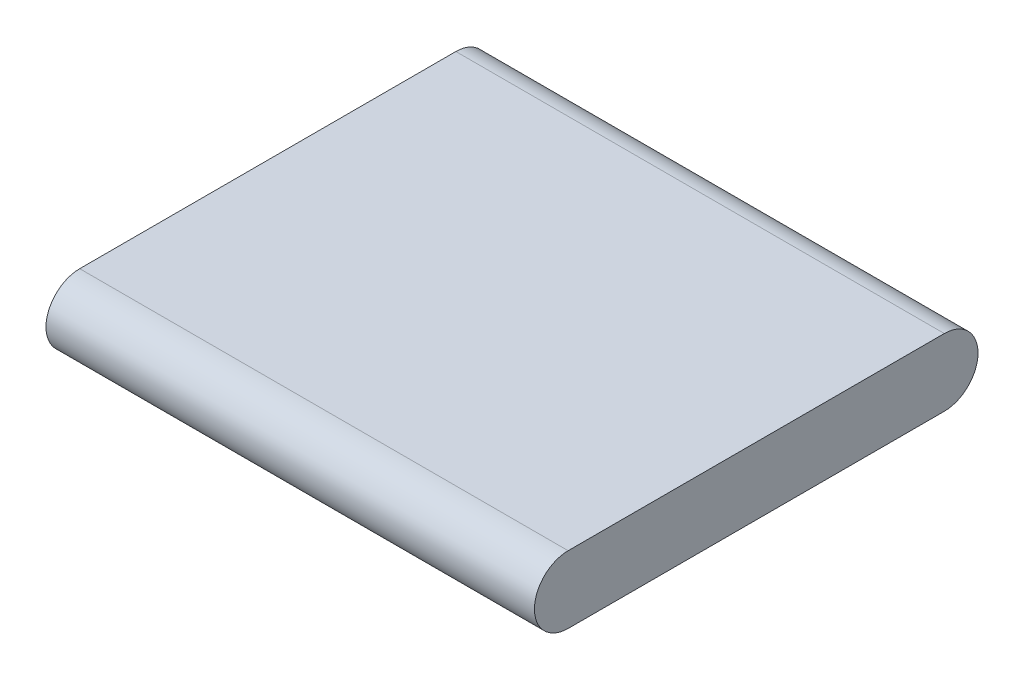
ISO-10303-21;
HEADER;
FILE_DESCRIPTION(('STEP AP214'),'2;1');
FILE_NAME('part.step','',(''),(''),'','','');
FILE_SCHEMA(('AUTOMOTIVE_DESIGN { 1 0 10303 214 1 1 1 1 }'));
ENDSEC;
DATA;
#1=APPLICATION_CONTEXT('core data for automotive mechanical design processes');
#2=APPLICATION_PROTOCOL_DEFINITION('international standard','automotive_design',2000,#1);
#3=PRODUCT_CONTEXT('',#1,'mechanical');
#4=PRODUCT('Part','Part','',(#3));
#5=PRODUCT_RELATED_PRODUCT_CATEGORY('part','',(#4));
#6=PRODUCT_DEFINITION_FORMATION('','',#4);
#7=PRODUCT_DEFINITION_CONTEXT('part definition',#1,'design');
#8=PRODUCT_DEFINITION('design','',#6,#7);
#9=PRODUCT_DEFINITION_SHAPE('','',#8);
#10=(LENGTH_UNIT() NAMED_UNIT(*) SI_UNIT(.MILLI.,.METRE.));
#11=(NAMED_UNIT(*) PLANE_ANGLE_UNIT() SI_UNIT($,.RADIAN.));
#12=(NAMED_UNIT(*) SI_UNIT($,.STERADIAN.) SOLID_ANGLE_UNIT());
#13=UNCERTAINTY_MEASURE_WITH_UNIT(LENGTH_MEASURE(1.E-05),#10,'distance_accuracy_value','');
#14=(GEOMETRIC_REPRESENTATION_CONTEXT(3) GLOBAL_UNCERTAINTY_ASSIGNED_CONTEXT((#13)) GLOBAL_UNIT_ASSIGNED_CONTEXT((#10,
#11,#12)) REPRESENTATION_CONTEXT('',''));
#15=CARTESIAN_POINT('',(0.,0.,0.));
#16=DIRECTION('',(0.,0.,1.));
#17=DIRECTION('',(1.,0.,0.));
#18=AXIS2_PLACEMENT_3D('',#15,#16,#17);
#19=CARTESIAN_POINT('',(21.75,3.,19.75));
#20=DIRECTION('',(-1.,0.,0.));
#21=DIRECTION('',(0.,0.,1.));
#22=AXIS2_PLACEMENT_3D('',#19,#20,#21);
#23=PLANE('',#22);
#24=CARTESIAN_POINT('',(21.75,0.,16.75));
#25=DIRECTION('',(-1.,0.,0.));
#26=DIRECTION('',(0.,0.,1.));
#27=AXIS2_PLACEMENT_3D('',#24,#25,#26);
#28=CIRCLE('',#27,3.);
#29=CARTESIAN_POINT('',(21.75,3.,16.75));
#30=VERTEX_POINT('',#29);
#31=CARTESIAN_POINT('',(21.75,0.,19.75));
#32=VERTEX_POINT('',#31);
#33=EDGE_CURVE('E203',#30,#32,#28,.F.);
#34=ORIENTED_EDGE('',*,*,#33,.T.);
#35=CARTESIAN_POINT('',(21.75,0.,16.75));
#36=DIRECTION('',(-1.,0.,0.));
#37=DIRECTION('',(0.,0.,1.));
#38=AXIS2_PLACEMENT_3D('',#35,#36,#37);
#39=CIRCLE('',#38,3.);
#40=CARTESIAN_POINT('',(21.75,-3.,16.75));
#41=VERTEX_POINT('',#40);
#42=EDGE_CURVE('E205',#32,#41,#39,.F.);
#43=ORIENTED_EDGE('',*,*,#42,.T.);
#44=DIRECTION('',(0.,0.,-1.));
#45=VECTOR('',#44,1.);
#46=CARTESIAN_POINT('',(21.75,-3.,19.75));
#47=LINE('',#46,#45);
#48=CARTESIAN_POINT('',(21.75,-3.,-16.75));
#49=VERTEX_POINT('',#48);
#50=EDGE_CURVE('E194',#41,#49,#47,.T.);
#51=ORIENTED_EDGE('',*,*,#50,.T.);
#52=CARTESIAN_POINT('',(21.75,0.,-16.75));
#53=DIRECTION('',(-1.,0.,0.));
#54=DIRECTION('',(0.,0.,1.));
#55=AXIS2_PLACEMENT_3D('',#52,#53,#54);
#56=CIRCLE('',#55,3.);
#57=CARTESIAN_POINT('',(21.75,0.,-19.75));
#58=VERTEX_POINT('',#57);
#59=EDGE_CURVE('E200',#49,#58,#56,.F.);
#60=ORIENTED_EDGE('',*,*,#59,.T.);
#61=CARTESIAN_POINT('',(21.75,0.,-16.75));
#62=DIRECTION('',(-1.,0.,0.));
#63=DIRECTION('',(0.,0.,1.));
#64=AXIS2_PLACEMENT_3D('',#61,#62,#63);
#65=CIRCLE('',#64,3.);
#66=CARTESIAN_POINT('',(21.75,3.,-16.75));
#67=VERTEX_POINT('',#66);
#68=EDGE_CURVE('E193',#58,#67,#65,.F.);
#69=ORIENTED_EDGE('',*,*,#68,.T.);
#70=DIRECTION('',(0.,0.,-1.));
#71=VECTOR('',#70,1.);
#72=CARTESIAN_POINT('',(21.75,3.,19.75));
#73=LINE('',#72,#71);
#74=EDGE_CURVE('E186',#30,#67,#73,.T.);
#75=ORIENTED_EDGE('',*,*,#74,.F.);
#76=EDGE_LOOP('',(#34,#43,#51,#60,#69,#75));
#77=FACE_BOUND('',#76,.T.);
#78=ADVANCED_FACE('F40',(#77),#23,.F.);
#79=CARTESIAN_POINT('',(-21.75,3.,19.75));
#80=DIRECTION('',(1.,0.,0.));
#81=DIRECTION('',(0.,0.,-1.));
#82=AXIS2_PLACEMENT_3D('',#79,#80,#81);
#83=PLANE('',#82);
#84=DIRECTION('',(0.,0.,1.));
#85=VECTOR('',#84,1.);
#86=CARTESIAN_POINT('',(-21.75,-3.,19.75));
#87=LINE('',#86,#85);
#88=CARTESIAN_POINT('',(-21.75,-3.,-16.75));
#89=VERTEX_POINT('',#88);
#90=CARTESIAN_POINT('',(-21.75,-3.,16.75));
#91=VERTEX_POINT('',#90);
#92=EDGE_CURVE('E190',#89,#91,#87,.T.);
#93=ORIENTED_EDGE('',*,*,#92,.T.);
#94=CARTESIAN_POINT('',(-21.75,0.,16.75));
#95=DIRECTION('',(1.,0.,0.));
#96=DIRECTION('',(0.,0.,-1.));
#97=AXIS2_PLACEMENT_3D('',#94,#95,#96);
#98=CIRCLE('',#97,3.);
#99=CARTESIAN_POINT('',(-21.75,3.,16.75));
#100=VERTEX_POINT('',#99);
#101=EDGE_CURVE('E213',#91,#100,#98,.F.);
#102=ORIENTED_EDGE('',*,*,#101,.T.);
#103=DIRECTION('',(0.,0.,1.));
#104=VECTOR('',#103,1.);
#105=CARTESIAN_POINT('',(-21.75,3.,19.75));
#106=LINE('',#105,#104);
#107=CARTESIAN_POINT('',(-21.75,3.,-16.75));
#108=VERTEX_POINT('',#107);
#109=EDGE_CURVE('E189',#108,#100,#106,.T.);
#110=ORIENTED_EDGE('',*,*,#109,.F.);
#111=CARTESIAN_POINT('',(-21.75,0.,-16.75));
#112=DIRECTION('',(1.,0.,0.));
#113=DIRECTION('',(0.,0.,-1.));
#114=AXIS2_PLACEMENT_3D('',#111,#112,#113);
#115=CIRCLE('',#114,3.);
#116=EDGE_CURVE('E211',#108,#89,#115,.F.);
#117=ORIENTED_EDGE('',*,*,#116,.T.);
#118=EDGE_LOOP('',(#93,#102,#110,#117));
#119=FACE_BOUND('',#118,.T.);
#120=CARTESIAN_POINT('',(-21.75,0.,0.));
#121=DIRECTION('',(-1.,0.,0.));
#122=DIRECTION('',(0.,0.,1.));
#123=AXIS2_PLACEMENT_3D('',#120,#121,#122);
#124=CIRCLE('',#123,0.988712690116245);
#125=CARTESIAN_POINT('',(-21.75,0.,0.988712690116245));
#126=VERTEX_POINT('',#125);
#127=EDGE_CURVE('E389',#126,#126,#124,.T.);
#128=ORIENTED_EDGE('',*,*,#127,.F.);
#129=EDGE_LOOP('',(#128));
#130=FACE_BOUND('',#129,.T.);
#131=ADVANCED_FACE('F230',(#119,#130),#83,.F.);
#132=CARTESIAN_POINT('',(0.,3.,0.));
#133=DIRECTION('',(0.,-1.,0.));
#134=DIRECTION('',(0.,0.,-1.));
#135=AXIS2_PLACEMENT_3D('',#132,#133,#134);
#136=PLANE('',#135);
#137=DIRECTION('',(1.,0.,0.));
#138=VECTOR('',#137,1.);
#139=CARTESIAN_POINT('',(0.,3.,16.75));
#140=LINE('',#139,#138);
#141=EDGE_CURVE('E48',#100,#30,#140,.T.);
#142=ORIENTED_EDGE('',*,*,#141,.T.);
#143=ORIENTED_EDGE('',*,*,#74,.T.);
#144=DIRECTION('',(-1.,0.,0.));
#145=VECTOR('',#144,1.);
#146=CARTESIAN_POINT('',(0.,3.,-16.75));
#147=LINE('',#146,#145);
#148=EDGE_CURVE('E215',#67,#108,#147,.T.);
#149=ORIENTED_EDGE('',*,*,#148,.T.);
#150=ORIENTED_EDGE('',*,*,#109,.T.);
#151=EDGE_LOOP('',(#142,#143,#149,#150));
#152=FACE_BOUND('',#151,.T.);
#153=ADVANCED_FACE('F227',(#152),#136,.F.);
#154=CARTESIAN_POINT('',(0.,-3.,0.));
#155=DIRECTION('',(0.,-1.,0.));
#156=DIRECTION('',(0.,0.,-1.));
#157=AXIS2_PLACEMENT_3D('',#154,#155,#156);
#158=PLANE('',#157);
#159=DIRECTION('',(-1.,0.,0.));
#160=VECTOR('',#159,1.);
#161=CARTESIAN_POINT('',(21.75,-3.,-16.75));
#162=LINE('',#161,#160);
#163=EDGE_CURVE('E207',#89,#49,#162,.F.);
#164=ORIENTED_EDGE('',*,*,#163,.T.);
#165=ORIENTED_EDGE('',*,*,#50,.F.);
#166=DIRECTION('',(1.,0.,0.));
#167=VECTOR('',#166,1.);
#168=CARTESIAN_POINT('',(-21.75,-3.,16.75));
#169=LINE('',#168,#167);
#170=EDGE_CURVE('E209',#41,#91,#169,.F.);
#171=ORIENTED_EDGE('',*,*,#170,.T.);
#172=ORIENTED_EDGE('',*,*,#92,.F.);
#173=EDGE_LOOP('',(#164,#165,#171,#172));
#174=FACE_BOUND('',#173,.T.);
#175=ADVANCED_FACE('F238',(#174),#158,.T.);
#176=CARTESIAN_POINT('',(0.,0.,16.75));
#177=DIRECTION('',(1.,0.,0.));
#178=DIRECTION('',(0.,0.,-1.));
#179=AXIS2_PLACEMENT_3D('',#176,#177,#178);
#180=CYLINDRICAL_SURFACE('',#179,3.);
#181=ORIENTED_EDGE('',*,*,#101,.F.);
#182=ORIENTED_EDGE('',*,*,#170,.F.);
#183=ORIENTED_EDGE('',*,*,#42,.F.);
#184=DIRECTION('',(1.,0.,0.));
#185=VECTOR('',#184,1.);
#186=CARTESIAN_POINT('',(-21.75,0.,19.75));
#187=LINE('',#186,#185);
#188=CARTESIAN_POINT('',(-20.75,0.,19.75));
#189=VERTEX_POINT('',#188);
#190=EDGE_CURVE('E54',#32,#189,#187,.F.);
#191=ORIENTED_EDGE('',*,*,#190,.T.);
#192=ORIENTED_EDGE('',*,*,#190,.F.);
#193=ORIENTED_EDGE('',*,*,#33,.F.);
#194=ORIENTED_EDGE('',*,*,#141,.F.);
#195=EDGE_LOOP('',(#181,#182,#183,#191,#192,#193,#194));
#196=FACE_BOUND('',#195,.T.);
#197=ADVANCED_FACE('F235',(#196),#180,.T.);
#198=CARTESIAN_POINT('',(0.,0.,-16.75));
#199=DIRECTION('',(-1.,0.,0.));
#200=DIRECTION('',(0.,0.,1.));
#201=AXIS2_PLACEMENT_3D('',#198,#199,#200);
#202=CYLINDRICAL_SURFACE('',#201,3.);
#203=ORIENTED_EDGE('',*,*,#116,.F.);
#204=ORIENTED_EDGE('',*,*,#148,.F.);
#205=ORIENTED_EDGE('',*,*,#68,.F.);
#206=DIRECTION('',(-1.,0.,0.));
#207=VECTOR('',#206,1.);
#208=CARTESIAN_POINT('',(-21.75,0.,-19.75));
#209=LINE('',#208,#207);
#210=CARTESIAN_POINT('',(-20.75,0.,-19.75));
#211=VERTEX_POINT('',#210);
#212=EDGE_CURVE('E60',#211,#58,#209,.F.);
#213=ORIENTED_EDGE('',*,*,#212,.F.);
#214=ORIENTED_EDGE('',*,*,#212,.T.);
#215=ORIENTED_EDGE('',*,*,#59,.F.);
#216=ORIENTED_EDGE('',*,*,#163,.F.);
#217=EDGE_LOOP('',(#203,#204,#205,#213,#214,#215,#216));
#218=FACE_BOUND('',#217,.T.);
#219=ADVANCED_FACE('F42',(#218),#202,.T.);
#220=CARTESIAN_POINT('',(-20.75,0.,-16.75));
#221=DIRECTION('',(-1.,0.,0.));
#222=DIRECTION('',(0.,0.,1.));
#223=AXIS2_PLACEMENT_3D('',#220,#221,#222);
#224=PLANE('',#223);
#225=CARTESIAN_POINT('',(-20.75,0.,0.));
#226=DIRECTION('',(-1.,0.,0.));
#227=DIRECTION('',(0.,0.,1.));
#228=AXIS2_PLACEMENT_3D('',#225,#226,#227);
#229=CIRCLE('',#228,0.988712690116245);
#230=CARTESIAN_POINT('',(-20.75,0.,0.988712690116245));
#231=VERTEX_POINT('',#230);
#232=EDGE_CURVE('E147',#231,#231,#229,.T.);
#233=ORIENTED_EDGE('',*,*,#232,.T.);
#234=EDGE_LOOP('',(#233));
#235=FACE_BOUND('',#234,.T.);
#236=DIRECTION('',(0.,0.,-1.));
#237=VECTOR('',#236,1.);
#238=CARTESIAN_POINT('',(-20.75,2.,0.));
#239=LINE('',#238,#237);
#240=CARTESIAN_POINT('',(-20.75,2.,16.75));
#241=VERTEX_POINT('',#240);
#242=CARTESIAN_POINT('',(-20.75,2.,-16.75));
#243=VERTEX_POINT('',#242);
#244=EDGE_CURVE('E157',#241,#243,#239,.T.);
#245=ORIENTED_EDGE('',*,*,#244,.F.);
#246=CARTESIAN_POINT('',(-20.75,0.,16.75));
#247=DIRECTION('',(-1.,0.,0.));
#248=DIRECTION('',(0.,0.,1.));
#249=AXIS2_PLACEMENT_3D('',#246,#247,#248);
#250=CIRCLE('',#249,2.);
#251=CARTESIAN_POINT('',(-20.75,0.,18.75));
#252=VERTEX_POINT('',#251);
#253=EDGE_CURVE('E136',#241,#252,#250,.F.);
#254=ORIENTED_EDGE('',*,*,#253,.T.);
#255=CARTESIAN_POINT('',(-20.75,0.,16.75));
#256=DIRECTION('',(-1.,0.,0.));
#257=DIRECTION('',(0.,0.,1.));
#258=AXIS2_PLACEMENT_3D('',#255,#256,#257);
#259=CIRCLE('',#258,2.);
#260=CARTESIAN_POINT('',(-20.75,-2.,16.75));
#261=VERTEX_POINT('',#260);
#262=EDGE_CURVE('E153',#252,#261,#259,.F.);
#263=ORIENTED_EDGE('',*,*,#262,.T.);
#264=DIRECTION('',(0.,0.,-1.));
#265=VECTOR('',#264,1.);
#266=CARTESIAN_POINT('',(-20.75,-2.,0.));
#267=LINE('',#266,#265);
#268=CARTESIAN_POINT('',(-20.75,-2.,-16.75));
#269=VERTEX_POINT('',#268);
#270=EDGE_CURVE('E146',#261,#269,#267,.T.);
#271=ORIENTED_EDGE('',*,*,#270,.T.);
#272=CARTESIAN_POINT('',(-20.75,0.,-16.75));
#273=DIRECTION('',(-1.,0.,0.));
#274=DIRECTION('',(0.,0.,1.));
#275=AXIS2_PLACEMENT_3D('',#272,#273,#274);
#276=CIRCLE('',#275,2.);
#277=CARTESIAN_POINT('',(-20.75,0.,-18.75));
#278=VERTEX_POINT('',#277);
#279=EDGE_CURVE('E11',#269,#278,#276,.F.);
#280=ORIENTED_EDGE('',*,*,#279,.T.);
#281=CARTESIAN_POINT('',(-20.75,0.,-16.75));
#282=DIRECTION('',(-1.,0.,0.));
#283=DIRECTION('',(0.,0.,1.));
#284=AXIS2_PLACEMENT_3D('',#281,#282,#283);
#285=CIRCLE('',#284,2.);
#286=EDGE_CURVE('E140',#278,#243,#285,.F.);
#287=ORIENTED_EDGE('',*,*,#286,.T.);
#288=EDGE_LOOP('',(#245,#254,#263,#271,#280,#287));
#289=FACE_BOUND('',#288,.T.);
#290=ADVANCED_FACE('F150',(#235,#289),#224,.F.);
#291=CARTESIAN_POINT('',(-20.75,0.,0.));
#292=DIRECTION('',(-1.,0.,0.));
#293=DIRECTION('',(0.,0.,1.));
#294=AXIS2_PLACEMENT_3D('',#291,#292,#293);
#295=CYLINDRICAL_SURFACE('',#294,0.988712690116245);
#296=ORIENTED_EDGE('',*,*,#232,.F.);
#297=EDGE_LOOP('',(#296));
#298=FACE_BOUND('',#297,.T.);
#299=ORIENTED_EDGE('',*,*,#127,.T.);
#300=EDGE_LOOP('',(#299));
#301=FACE_BOUND('',#300,.T.);
#302=ADVANCED_FACE('F289',(#298,#301),#295,.F.);
#303=CARTESIAN_POINT('',(20.75,3.,19.75));
#304=DIRECTION('',(-1.,0.,0.));
#305=DIRECTION('',(0.,0.,1.));
#306=AXIS2_PLACEMENT_3D('',#303,#304,#305);
#307=PLANE('',#306);
#308=CARTESIAN_POINT('',(20.75,0.,16.75));
#309=DIRECTION('',(-1.,0.,0.));
#310=DIRECTION('',(0.,0.,1.));
#311=AXIS2_PLACEMENT_3D('',#308,#309,#310);
#312=CIRCLE('',#311,2.);
#313=CARTESIAN_POINT('',(20.75,2.,16.75));
#314=VERTEX_POINT('',#313);
#315=CARTESIAN_POINT('',(20.75,0.,18.75));
#316=VERTEX_POINT('',#315);
#317=EDGE_CURVE('E164',#314,#316,#312,.F.);
#318=ORIENTED_EDGE('',*,*,#317,.F.);
#319=DIRECTION('',(0.,0.,-1.));
#320=VECTOR('',#319,1.);
#321=CARTESIAN_POINT('',(20.75,2.,0.));
#322=LINE('',#321,#320);
#323=CARTESIAN_POINT('',(20.75,2.,-16.75));
#324=VERTEX_POINT('',#323);
#325=EDGE_CURVE('E172',#314,#324,#322,.T.);
#326=ORIENTED_EDGE('',*,*,#325,.T.);
#327=CARTESIAN_POINT('',(20.75,0.,-16.75));
#328=DIRECTION('',(-1.,0.,0.));
#329=DIRECTION('',(0.,0.,1.));
#330=AXIS2_PLACEMENT_3D('',#327,#328,#329);
#331=CIRCLE('',#330,2.);
#332=CARTESIAN_POINT('',(20.75,0.,-18.75));
#333=VERTEX_POINT('',#332);
#334=EDGE_CURVE('E174',#333,#324,#331,.F.);
#335=ORIENTED_EDGE('',*,*,#334,.F.);
#336=CARTESIAN_POINT('',(20.75,0.,-16.75));
#337=DIRECTION('',(-1.,0.,0.));
#338=DIRECTION('',(0.,0.,1.));
#339=AXIS2_PLACEMENT_3D('',#336,#337,#338);
#340=CIRCLE('',#339,2.);
#341=CARTESIAN_POINT('',(20.75,-2.,-16.75));
#342=VERTEX_POINT('',#341);
#343=EDGE_CURVE('E132',#342,#333,#340,.F.);
#344=ORIENTED_EDGE('',*,*,#343,.F.);
#345=DIRECTION('',(0.,0.,-1.));
#346=VECTOR('',#345,1.);
#347=CARTESIAN_POINT('',(20.75,-2.,0.));
#348=LINE('',#347,#346);
#349=CARTESIAN_POINT('',(20.75,-2.,16.75));
#350=VERTEX_POINT('',#349);
#351=EDGE_CURVE('E169',#350,#342,#348,.T.);
#352=ORIENTED_EDGE('',*,*,#351,.F.);
#353=CARTESIAN_POINT('',(20.75,0.,16.75));
#354=DIRECTION('',(-1.,0.,0.));
#355=DIRECTION('',(0.,0.,1.));
#356=AXIS2_PLACEMENT_3D('',#353,#354,#355);
#357=CIRCLE('',#356,2.);
#358=EDGE_CURVE('E166',#316,#350,#357,.F.);
#359=ORIENTED_EDGE('',*,*,#358,.F.);
#360=EDGE_LOOP('',(#318,#326,#335,#344,#352,#359));
#361=FACE_BOUND('',#360,.T.);
#362=ADVANCED_FACE('F299',(#361),#307,.T.);
#363=CARTESIAN_POINT('',(-21.75,0.,-16.75));
#364=DIRECTION('',(1.,0.,0.));
#365=DIRECTION('',(0.,0.,-1.));
#366=AXIS2_PLACEMENT_3D('',#363,#364,#365);
#367=CYLINDRICAL_SURFACE('',#366,2.);
#368=ORIENTED_EDGE('',*,*,#279,.F.);
#369=DIRECTION('',(1.,0.,0.));
#370=VECTOR('',#369,1.);
#371=CARTESIAN_POINT('',(0.,-2.,-16.75));
#372=LINE('',#371,#370);
#373=EDGE_CURVE('E168',#269,#342,#372,.T.);
#374=ORIENTED_EDGE('',*,*,#373,.T.);
#375=ORIENTED_EDGE('',*,*,#343,.T.);
#376=DIRECTION('',(1.,0.,0.));
#377=VECTOR('',#376,1.);
#378=CARTESIAN_POINT('',(-21.75,0.,-18.75));
#379=LINE('',#378,#377);
#380=EDGE_CURVE('E127',#278,#333,#379,.T.);
#381=ORIENTED_EDGE('',*,*,#380,.F.);
#382=EDGE_LOOP('',(#368,#374,#375,#381));
#383=FACE_BOUND('',#382,.T.);
#384=ADVANCED_FACE('F129',(#383),#367,.F.);
#385=CARTESIAN_POINT('',(0.,0.,-16.75));
#386=DIRECTION('',(-1.,0.,0.));
#387=DIRECTION('',(0.,0.,1.));
#388=AXIS2_PLACEMENT_3D('',#385,#386,#387);
#389=CYLINDRICAL_SURFACE('',#388,2.);
#390=ORIENTED_EDGE('',*,*,#286,.F.);
#391=ORIENTED_EDGE('',*,*,#380,.T.);
#392=ORIENTED_EDGE('',*,*,#334,.T.);
#393=DIRECTION('',(1.,0.,0.));
#394=VECTOR('',#393,1.);
#395=CARTESIAN_POINT('',(0.,2.,-16.75));
#396=LINE('',#395,#394);
#397=EDGE_CURVE('E143',#324,#243,#396,.F.);
#398=ORIENTED_EDGE('',*,*,#397,.T.);
#399=EDGE_LOOP('',(#390,#391,#392,#398));
#400=FACE_BOUND('',#399,.T.);
#401=ADVANCED_FACE('F141',(#400),#389,.F.);
#402=CARTESIAN_POINT('',(-21.75,0.,16.75));
#403=DIRECTION('',(-1.,0.,0.));
#404=DIRECTION('',(0.,0.,1.));
#405=AXIS2_PLACEMENT_3D('',#402,#403,#404);
#406=CYLINDRICAL_SURFACE('',#405,2.);
#407=ORIENTED_EDGE('',*,*,#262,.F.);
#408=DIRECTION('',(-1.,0.,0.));
#409=VECTOR('',#408,1.);
#410=CARTESIAN_POINT('',(-21.75,0.,18.75));
#411=LINE('',#410,#409);
#412=EDGE_CURVE('E135',#316,#252,#411,.T.);
#413=ORIENTED_EDGE('',*,*,#412,.F.);
#414=ORIENTED_EDGE('',*,*,#358,.T.);
#415=DIRECTION('',(1.,0.,0.));
#416=VECTOR('',#415,1.);
#417=CARTESIAN_POINT('',(0.,-2.,16.75));
#418=LINE('',#417,#416);
#419=EDGE_CURVE('E181',#350,#261,#418,.F.);
#420=ORIENTED_EDGE('',*,*,#419,.T.);
#421=EDGE_LOOP('',(#407,#413,#414,#420));
#422=FACE_BOUND('',#421,.T.);
#423=ADVANCED_FACE('F319',(#422),#406,.F.);
#424=CARTESIAN_POINT('',(0.,0.,16.75));
#425=DIRECTION('',(1.,0.,0.));
#426=DIRECTION('',(0.,0.,-1.));
#427=AXIS2_PLACEMENT_3D('',#424,#425,#426);
#428=CYLINDRICAL_SURFACE('',#427,2.);
#429=ORIENTED_EDGE('',*,*,#253,.F.);
#430=DIRECTION('',(1.,0.,0.));
#431=VECTOR('',#430,1.);
#432=CARTESIAN_POINT('',(0.,2.,16.75));
#433=LINE('',#432,#431);
#434=EDGE_CURVE('E178',#241,#314,#433,.T.);
#435=ORIENTED_EDGE('',*,*,#434,.T.);
#436=ORIENTED_EDGE('',*,*,#317,.T.);
#437=ORIENTED_EDGE('',*,*,#412,.T.);
#438=EDGE_LOOP('',(#429,#435,#436,#437));
#439=FACE_BOUND('',#438,.T.);
#440=ADVANCED_FACE('F328',(#439),#428,.F.);
#441=CARTESIAN_POINT('',(0.,-2.,0.));
#442=DIRECTION('',(0.,-1.,0.));
#443=DIRECTION('',(0.,0.,-1.));
#444=AXIS2_PLACEMENT_3D('',#441,#442,#443);
#445=PLANE('',#444);
#446=ORIENTED_EDGE('',*,*,#270,.F.);
#447=ORIENTED_EDGE('',*,*,#419,.F.);
#448=ORIENTED_EDGE('',*,*,#351,.T.);
#449=ORIENTED_EDGE('',*,*,#373,.F.);
#450=EDGE_LOOP('',(#446,#447,#448,#449));
#451=FACE_BOUND('',#450,.T.);
#452=ADVANCED_FACE('F338',(#451),#445,.F.);
#453=CARTESIAN_POINT('',(0.,2.,0.));
#454=DIRECTION('',(0.,-1.,0.));
#455=DIRECTION('',(0.,0.,-1.));
#456=AXIS2_PLACEMENT_3D('',#453,#454,#455);
#457=PLANE('',#456);
#458=ORIENTED_EDGE('',*,*,#434,.F.);
#459=ORIENTED_EDGE('',*,*,#244,.T.);
#460=ORIENTED_EDGE('',*,*,#397,.F.);
#461=ORIENTED_EDGE('',*,*,#325,.F.);
#462=EDGE_LOOP('',(#458,#459,#460,#461));
#463=FACE_BOUND('',#462,.T.);
#464=ADVANCED_FACE('F348',(#463),#457,.T.);
#465=CLOSED_SHELL('',(#78,#131,#153,#175,#197,#219,#290,#302,#362,#384,#401,#423,#440,#452,#464));
#466=MANIFOLD_SOLID_BREP('B2',#465);
#467=ADVANCED_BREP_SHAPE_REPRESENTATION('',(#18,#466),#14);
#468=SHAPE_DEFINITION_REPRESENTATION(#9,#467);
ENDSEC;
END-ISO-10303-21;
